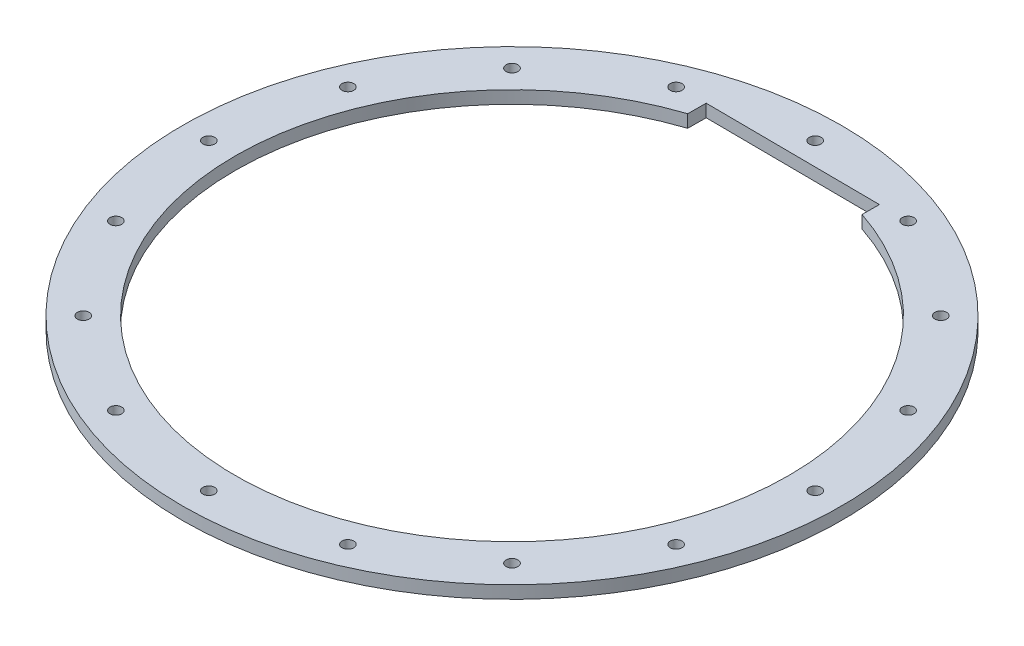
ISO-10303-21;
HEADER;
FILE_DESCRIPTION(('STEP AP214'),'2;1');
FILE_NAME('part.step','',(''),(''),'','','');
FILE_SCHEMA(('AUTOMOTIVE_DESIGN { 1 0 10303 214 1 1 1 1 }'));
ENDSEC;
DATA;
#1=APPLICATION_CONTEXT('core data for automotive mechanical design processes');
#2=APPLICATION_PROTOCOL_DEFINITION('international standard','automotive_design',2000,#1);
#3=PRODUCT_CONTEXT('',#1,'mechanical');
#4=PRODUCT('Part','Part','',(#3));
#5=PRODUCT_RELATED_PRODUCT_CATEGORY('part','',(#4));
#6=PRODUCT_DEFINITION_FORMATION('','',#4);
#7=PRODUCT_DEFINITION_CONTEXT('part definition',#1,'design');
#8=PRODUCT_DEFINITION('design','',#6,#7);
#9=PRODUCT_DEFINITION_SHAPE('','',#8);
#10=(LENGTH_UNIT() NAMED_UNIT(*) SI_UNIT(.MILLI.,.METRE.));
#11=(NAMED_UNIT(*) PLANE_ANGLE_UNIT() SI_UNIT($,.RADIAN.));
#12=(NAMED_UNIT(*) SI_UNIT($,.STERADIAN.) SOLID_ANGLE_UNIT());
#13=UNCERTAINTY_MEASURE_WITH_UNIT(LENGTH_MEASURE(1.E-05),#10,'distance_accuracy_value','');
#14=(GEOMETRIC_REPRESENTATION_CONTEXT(3) GLOBAL_UNCERTAINTY_ASSIGNED_CONTEXT((#13)) GLOBAL_UNIT_ASSIGNED_CONTEXT((#10,
#11,#12)) REPRESENTATION_CONTEXT('',''));
#15=CARTESIAN_POINT('',(0.,0.,0.));
#16=DIRECTION('',(0.,0.,1.));
#17=DIRECTION('',(1.,0.,0.));
#18=AXIS2_PLACEMENT_3D('',#15,#16,#17);
#19=CARTESIAN_POINT('',(0.,3.048,0.));
#20=DIRECTION('',(0.,1.,0.));
#21=DIRECTION('',(0.,0.,1.));
#22=AXIS2_PLACEMENT_3D('',#19,#20,#21);
#23=PLANE('',#22);
#24=CARTESIAN_POINT('',(-27.9454576484607,3.048,-67.4663028616367));
#25=DIRECTION('',(0.,1.,0.));
#26=DIRECTION('',(0.,0.,1.));
#27=AXIS2_PLACEMENT_3D('',#24,#25,#26);
#28=CIRCLE('',#27,1.42240000000098);
#29=CARTESIAN_POINT('',(-27.9454576484607,3.048,-66.0439028616357));
#30=VERTEX_POINT('',#29);
#31=EDGE_CURVE('E187',#30,#30,#28,.T.);
#32=ORIENTED_EDGE('',*,*,#31,.F.);
#33=EDGE_LOOP('',(#32));
#34=FACE_BOUND('',#33,.T.);
#35=CARTESIAN_POINT('',(-67.4663028616367,3.048,-27.9454576484607));
#36=DIRECTION('',(0.,1.,0.));
#37=DIRECTION('',(0.,0.,1.));
#38=AXIS2_PLACEMENT_3D('',#35,#36,#37);
#39=CIRCLE('',#38,1.42240000000074);
#40=CARTESIAN_POINT('',(-67.4663028616367,3.048,-26.52305764846));
#41=VERTEX_POINT('',#40);
#42=EDGE_CURVE('E175',#41,#41,#39,.T.);
#43=ORIENTED_EDGE('',*,*,#42,.F.);
#44=EDGE_LOOP('',(#43));
#45=FACE_BOUND('',#44,.T.);
#46=CARTESIAN_POINT('',(-67.4663028616367,3.048,27.9454576484607));
#47=DIRECTION('',(0.,1.,0.));
#48=DIRECTION('',(0.,0.,1.));
#49=AXIS2_PLACEMENT_3D('',#46,#47,#48);
#50=CIRCLE('',#49,1.42240000000076);
#51=CARTESIAN_POINT('',(-67.4663028616367,3.048,29.3678576484615));
#52=VERTEX_POINT('',#51);
#53=EDGE_CURVE('E163',#52,#52,#50,.T.);
#54=ORIENTED_EDGE('',*,*,#53,.F.);
#55=EDGE_LOOP('',(#54));
#56=FACE_BOUND('',#55,.T.);
#57=CARTESIAN_POINT('',(-27.9454576484607,3.048,67.4663028616367));
#58=DIRECTION('',(0.,1.,0.));
#59=DIRECTION('',(0.,0.,1.));
#60=AXIS2_PLACEMENT_3D('',#57,#58,#59);
#61=CIRCLE('',#60,1.42240000000056);
#62=CARTESIAN_POINT('',(-27.9454576484607,3.048,68.8887028616373));
#63=VERTEX_POINT('',#62);
#64=EDGE_CURVE('E151',#63,#63,#61,.T.);
#65=ORIENTED_EDGE('',*,*,#64,.F.);
#66=EDGE_LOOP('',(#65));
#67=FACE_BOUND('',#66,.T.);
#68=CARTESIAN_POINT('',(27.9454576484607,3.048,67.4663028616367));
#69=DIRECTION('',(0.,1.,0.));
#70=DIRECTION('',(0.,0.,1.));
#71=AXIS2_PLACEMENT_3D('',#68,#69,#70);
#72=CIRCLE('',#71,1.42240000000044);
#73=CARTESIAN_POINT('',(27.9454576484607,3.048,68.8887028616371));
#74=VERTEX_POINT('',#73);
#75=EDGE_CURVE('E139',#74,#74,#72,.T.);
#76=ORIENTED_EDGE('',*,*,#75,.F.);
#77=EDGE_LOOP('',(#76));
#78=FACE_BOUND('',#77,.T.);
#79=CARTESIAN_POINT('',(67.4663028616367,3.048,27.9454576484607));
#80=DIRECTION('',(0.,1.,0.));
#81=DIRECTION('',(0.,0.,1.));
#82=AXIS2_PLACEMENT_3D('',#79,#80,#81);
#83=CIRCLE('',#82,1.42240000000031);
#84=CARTESIAN_POINT('',(67.4663028616367,3.048,29.367857648461));
#85=VERTEX_POINT('',#84);
#86=EDGE_CURVE('E127',#85,#85,#83,.T.);
#87=ORIENTED_EDGE('',*,*,#86,.F.);
#88=EDGE_LOOP('',(#87));
#89=FACE_BOUND('',#88,.T.);
#90=CARTESIAN_POINT('',(67.4663028616367,3.048,-27.9454576484607));
#91=DIRECTION('',(0.,1.,0.));
#92=DIRECTION('',(0.,0.,1.));
#93=AXIS2_PLACEMENT_3D('',#90,#91,#92);
#94=CIRCLE('',#93,1.42240000000019);
#95=CARTESIAN_POINT('',(67.4663028616367,3.048,-26.5230576484605));
#96=VERTEX_POINT('',#95);
#97=EDGE_CURVE('E115',#96,#96,#94,.T.);
#98=ORIENTED_EDGE('',*,*,#97,.F.);
#99=EDGE_LOOP('',(#98));
#100=FACE_BOUND('',#99,.T.);
#101=CARTESIAN_POINT('',(27.9454576484618,3.048,-67.4663028616367));
#102=DIRECTION('',(0.,1.,0.));
#103=DIRECTION('',(0.,0.,1.));
#104=AXIS2_PLACEMENT_3D('',#101,#102,#103);
#105=CIRCLE('',#104,1.42239999999896);
#106=CARTESIAN_POINT('',(27.9454576484618,3.048,-66.0439028616377));
#107=VERTEX_POINT('',#106);
#108=EDGE_CURVE('E103',#107,#107,#105,.T.);
#109=ORIENTED_EDGE('',*,*,#108,.F.);
#110=EDGE_LOOP('',(#109));
#111=FACE_BOUND('',#110,.T.);
#112=CARTESIAN_POINT('',(0.,3.048,0.));
#113=DIRECTION('',(0.,1.,0.));
#114=DIRECTION('',(0.,0.,1.));
#115=AXIS2_PLACEMENT_3D('',#112,#113,#114);
#116=CIRCLE('',#115,79.375);
#117=CARTESIAN_POINT('',(0.,3.048,79.375));
#118=VERTEX_POINT('',#117);
#119=EDGE_CURVE('E11',#118,#118,#116,.T.);
#120=ORIENTED_EDGE('',*,*,#119,.T.);
#121=EDGE_LOOP('',(#120));
#122=FACE_BOUND('',#121,.T.);
#123=CARTESIAN_POINT('',(0.,3.048,-73.025));
#124=DIRECTION('',(0.,1.,0.));
#125=DIRECTION('',(0.,0.,1.));
#126=AXIS2_PLACEMENT_3D('',#123,#124,#125);
#127=CIRCLE('',#126,1.4224);
#128=CARTESIAN_POINT('',(0.,3.048,-71.6026));
#129=VERTEX_POINT('',#128);
#130=EDGE_CURVE('E97',#129,#129,#127,.T.);
#131=ORIENTED_EDGE('',*,*,#130,.F.);
#132=EDGE_LOOP('',(#131));
#133=FACE_BOUND('',#132,.T.);
#134=CARTESIAN_POINT('',(51.6364726961476,3.048,-51.6364726961476));
#135=DIRECTION('',(0.,1.,0.));
#136=DIRECTION('',(0.,0.,1.));
#137=AXIS2_PLACEMENT_3D('',#134,#135,#136);
#138=CIRCLE('',#137,1.42240000000012);
#139=CARTESIAN_POINT('',(51.6364726961476,3.048,-50.2140726961475));
#140=VERTEX_POINT('',#139);
#141=EDGE_CURVE('E109',#140,#140,#138,.T.);
#142=ORIENTED_EDGE('',*,*,#141,.F.);
#143=EDGE_LOOP('',(#142));
#144=FACE_BOUND('',#143,.T.);
#145=CARTESIAN_POINT('',(73.025,3.048,0.));
#146=DIRECTION('',(0.,1.,0.));
#147=DIRECTION('',(0.,0.,1.));
#148=AXIS2_PLACEMENT_3D('',#145,#146,#147);
#149=CIRCLE('',#148,1.42240000000025);
#150=CARTESIAN_POINT('',(73.025,3.048,1.42240000000025));
#151=VERTEX_POINT('',#150);
#152=EDGE_CURVE('E121',#151,#151,#149,.T.);
#153=ORIENTED_EDGE('',*,*,#152,.F.);
#154=EDGE_LOOP('',(#153));
#155=FACE_BOUND('',#154,.T.);
#156=CARTESIAN_POINT('',(51.6364726961476,3.048,51.6364726961476));
#157=DIRECTION('',(0.,1.,0.));
#158=DIRECTION('',(0.,0.,1.));
#159=AXIS2_PLACEMENT_3D('',#156,#157,#158);
#160=CIRCLE('',#159,1.42240000000036);
#161=CARTESIAN_POINT('',(51.6364726961476,3.048,53.058872696148));
#162=VERTEX_POINT('',#161);
#163=EDGE_CURVE('E133',#162,#162,#160,.T.);
#164=ORIENTED_EDGE('',*,*,#163,.F.);
#165=EDGE_LOOP('',(#164));
#166=FACE_BOUND('',#165,.T.);
#167=CARTESIAN_POINT('',(0.,3.048,73.025));
#168=DIRECTION('',(0.,1.,0.));
#169=DIRECTION('',(0.,0.,1.));
#170=AXIS2_PLACEMENT_3D('',#167,#168,#169);
#171=CIRCLE('',#170,1.4224000000005);
#172=CARTESIAN_POINT('',(0.,3.048,74.4474000000005));
#173=VERTEX_POINT('',#172);
#174=EDGE_CURVE('E145',#173,#173,#171,.T.);
#175=ORIENTED_EDGE('',*,*,#174,.F.);
#176=EDGE_LOOP('',(#175));
#177=FACE_BOUND('',#176,.T.);
#178=CARTESIAN_POINT('',(-51.6364726961476,3.048,51.6364726961476));
#179=DIRECTION('',(0.,1.,0.));
#180=DIRECTION('',(0.,0.,1.));
#181=AXIS2_PLACEMENT_3D('',#178,#179,#180);
#182=CIRCLE('',#181,1.42240000000064);
#183=CARTESIAN_POINT('',(-51.6364726961476,3.048,53.0588726961483));
#184=VERTEX_POINT('',#183);
#185=EDGE_CURVE('E157',#184,#184,#182,.T.);
#186=ORIENTED_EDGE('',*,*,#185,.F.);
#187=EDGE_LOOP('',(#186));
#188=FACE_BOUND('',#187,.T.);
#189=CARTESIAN_POINT('',(-73.025,3.048,0.));
#190=DIRECTION('',(0.,1.,0.));
#191=DIRECTION('',(0.,0.,1.));
#192=AXIS2_PLACEMENT_3D('',#189,#190,#191);
#193=CIRCLE('',#192,1.42240000000074);
#194=CARTESIAN_POINT('',(-73.025,3.048,1.42240000000076));
#195=VERTEX_POINT('',#194);
#196=EDGE_CURVE('E169',#195,#195,#193,.T.);
#197=ORIENTED_EDGE('',*,*,#196,.F.);
#198=EDGE_LOOP('',(#197));
#199=FACE_BOUND('',#198,.T.);
#200=CARTESIAN_POINT('',(-51.6364726961476,3.048,-51.6364726961476));
#201=DIRECTION('',(0.,1.,0.));
#202=DIRECTION('',(0.,0.,1.));
#203=AXIS2_PLACEMENT_3D('',#200,#201,#202);
#204=CIRCLE('',#203,1.42240000000086);
#205=CARTESIAN_POINT('',(-51.6364726961476,3.048,-50.2140726961468));
#206=VERTEX_POINT('',#205);
#207=EDGE_CURVE('E181',#206,#206,#204,.T.);
#208=ORIENTED_EDGE('',*,*,#207,.F.);
#209=EDGE_LOOP('',(#208));
#210=FACE_BOUND('',#209,.T.);
#211=CARTESIAN_POINT('',(0.,3.048,0.));
#212=DIRECTION('',(0.,1.,0.));
#213=DIRECTION('',(0.,0.,1.));
#214=AXIS2_PLACEMENT_3D('',#211,#212,#213);
#215=CIRCLE('',#214,66.675);
#216=CARTESIAN_POINT('',(-20.9722114369326,3.048,-63.290773201507));
#217=VERTEX_POINT('',#216);
#218=CARTESIAN_POINT('',(21.0402290478888,3.048,-63.2681941153087));
#219=VERTEX_POINT('',#218);
#220=EDGE_CURVE('E88',#217,#219,#215,.T.);
#221=ORIENTED_EDGE('',*,*,#220,.F.);
#222=DIRECTION('',(-0.00688562784600188,0.,0.999976293783591));
#223=VECTOR('',#222,1.);
#224=CARTESIAN_POINT('',(-21.407003484413,3.048,-0.1474041536865));
#225=LINE('',#224,#223);
#226=CARTESIAN_POINT('',(-20.941758021366,3.048,-67.7134190825203));
#227=VERTEX_POINT('',#226);
#228=EDGE_CURVE('E90',#227,#217,#225,.T.);
#229=ORIENTED_EDGE('',*,*,#228,.F.);
#230=DIRECTION('',(0.999976293783591,0.,0.00688562784600023));
#231=VECTOR('',#230,1.);
#232=CARTESIAN_POINT('',(0.465245463046875,3.048,-67.5660149288338));
#233=LINE('',#232,#231);
#234=CARTESIAN_POINT('',(21.0688460425527,3.048,-67.4241428397053));
#235=VERTEX_POINT('',#234);
#236=EDGE_CURVE('E89',#227,#235,#233,.T.);
#237=ORIENTED_EDGE('',*,*,#236,.T.);
#238=DIRECTION('',(-0.00688562784600024,0.,0.999976293783591));
#239=VECTOR('',#238,1.);
#240=CARTESIAN_POINT('',(20.6036005795058,3.048,0.141872089128559));
#241=LINE('',#240,#239);
#242=EDGE_CURVE('E77',#235,#219,#241,.T.);
#243=ORIENTED_EDGE('',*,*,#242,.T.);
#244=EDGE_LOOP('',(#221,#229,#237,#243));
#245=FACE_BOUND('',#244,.T.);
#246=ADVANCED_FACE('F32',(#34,#45,#56,#67,#78,#89,#100,#111,#122,#133,#144,#155,#166,#177,#188,
#199,#210,#245),#23,.T.);
#247=CARTESIAN_POINT('',(0.,0.,0.));
#248=DIRECTION('',(0.,1.,0.));
#249=DIRECTION('',(0.,0.,1.));
#250=AXIS2_PLACEMENT_3D('',#247,#248,#249);
#251=PLANE('',#250);
#252=CARTESIAN_POINT('',(-27.9454576484607,0.,-67.4663028616367));
#253=DIRECTION('',(0.,1.,0.));
#254=DIRECTION('',(0.,0.,1.));
#255=AXIS2_PLACEMENT_3D('',#252,#253,#254);
#256=CIRCLE('',#255,1.42240000000098);
#257=CARTESIAN_POINT('',(-27.9454576484607,0.,-66.0439028616357));
#258=VERTEX_POINT('',#257);
#259=EDGE_CURVE('E190',#258,#258,#256,.T.);
#260=ORIENTED_EDGE('',*,*,#259,.T.);
#261=EDGE_LOOP('',(#260));
#262=FACE_BOUND('',#261,.T.);
#263=CARTESIAN_POINT('',(-67.4663028616367,0.,-27.9454576484607));
#264=DIRECTION('',(0.,1.,0.));
#265=DIRECTION('',(0.,0.,1.));
#266=AXIS2_PLACEMENT_3D('',#263,#264,#265);
#267=CIRCLE('',#266,1.42240000000074);
#268=CARTESIAN_POINT('',(-67.4663028616367,0.,-26.52305764846));
#269=VERTEX_POINT('',#268);
#270=EDGE_CURVE('E178',#269,#269,#267,.T.);
#271=ORIENTED_EDGE('',*,*,#270,.T.);
#272=EDGE_LOOP('',(#271));
#273=FACE_BOUND('',#272,.T.);
#274=CARTESIAN_POINT('',(-67.4663028616367,0.,27.9454576484607));
#275=DIRECTION('',(0.,1.,0.));
#276=DIRECTION('',(0.,0.,1.));
#277=AXIS2_PLACEMENT_3D('',#274,#275,#276);
#278=CIRCLE('',#277,1.42240000000076);
#279=CARTESIAN_POINT('',(-67.4663028616367,0.,29.3678576484615));
#280=VERTEX_POINT('',#279);
#281=EDGE_CURVE('E166',#280,#280,#278,.T.);
#282=ORIENTED_EDGE('',*,*,#281,.T.);
#283=EDGE_LOOP('',(#282));
#284=FACE_BOUND('',#283,.T.);
#285=CARTESIAN_POINT('',(-27.9454576484607,0.,67.4663028616367));
#286=DIRECTION('',(0.,1.,0.));
#287=DIRECTION('',(0.,0.,1.));
#288=AXIS2_PLACEMENT_3D('',#285,#286,#287);
#289=CIRCLE('',#288,1.42240000000056);
#290=CARTESIAN_POINT('',(-27.9454576484607,0.,68.8887028616373));
#291=VERTEX_POINT('',#290);
#292=EDGE_CURVE('E154',#291,#291,#289,.T.);
#293=ORIENTED_EDGE('',*,*,#292,.T.);
#294=EDGE_LOOP('',(#293));
#295=FACE_BOUND('',#294,.T.);
#296=CARTESIAN_POINT('',(27.9454576484607,0.,67.4663028616367));
#297=DIRECTION('',(0.,1.,0.));
#298=DIRECTION('',(0.,0.,1.));
#299=AXIS2_PLACEMENT_3D('',#296,#297,#298);
#300=CIRCLE('',#299,1.42240000000044);
#301=CARTESIAN_POINT('',(27.9454576484607,0.,68.8887028616371));
#302=VERTEX_POINT('',#301);
#303=EDGE_CURVE('E142',#302,#302,#300,.T.);
#304=ORIENTED_EDGE('',*,*,#303,.T.);
#305=EDGE_LOOP('',(#304));
#306=FACE_BOUND('',#305,.T.);
#307=CARTESIAN_POINT('',(67.4663028616367,0.,27.9454576484607));
#308=DIRECTION('',(0.,1.,0.));
#309=DIRECTION('',(0.,0.,1.));
#310=AXIS2_PLACEMENT_3D('',#307,#308,#309);
#311=CIRCLE('',#310,1.42240000000031);
#312=CARTESIAN_POINT('',(67.4663028616367,0.,29.367857648461));
#313=VERTEX_POINT('',#312);
#314=EDGE_CURVE('E130',#313,#313,#311,.T.);
#315=ORIENTED_EDGE('',*,*,#314,.T.);
#316=EDGE_LOOP('',(#315));
#317=FACE_BOUND('',#316,.T.);
#318=CARTESIAN_POINT('',(67.4663028616367,0.,-27.9454576484607));
#319=DIRECTION('',(0.,1.,0.));
#320=DIRECTION('',(0.,0.,1.));
#321=AXIS2_PLACEMENT_3D('',#318,#319,#320);
#322=CIRCLE('',#321,1.42240000000019);
#323=CARTESIAN_POINT('',(67.4663028616367,0.,-26.5230576484605));
#324=VERTEX_POINT('',#323);
#325=EDGE_CURVE('E118',#324,#324,#322,.T.);
#326=ORIENTED_EDGE('',*,*,#325,.T.);
#327=EDGE_LOOP('',(#326));
#328=FACE_BOUND('',#327,.T.);
#329=CARTESIAN_POINT('',(27.9454576484618,0.,-67.4663028616367));
#330=DIRECTION('',(0.,1.,0.));
#331=DIRECTION('',(0.,0.,1.));
#332=AXIS2_PLACEMENT_3D('',#329,#330,#331);
#333=CIRCLE('',#332,1.42239999999896);
#334=CARTESIAN_POINT('',(27.9454576484618,0.,-66.0439028616377));
#335=VERTEX_POINT('',#334);
#336=EDGE_CURVE('E106',#335,#335,#333,.T.);
#337=ORIENTED_EDGE('',*,*,#336,.T.);
#338=EDGE_LOOP('',(#337));
#339=FACE_BOUND('',#338,.T.);
#340=CARTESIAN_POINT('',(0.,0.,0.));
#341=DIRECTION('',(0.,1.,0.));
#342=DIRECTION('',(0.,0.,1.));
#343=AXIS2_PLACEMENT_3D('',#340,#341,#342);
#344=CIRCLE('',#343,79.375);
#345=CARTESIAN_POINT('',(0.,0.,79.375));
#346=VERTEX_POINT('',#345);
#347=EDGE_CURVE('E36',#346,#346,#344,.T.);
#348=ORIENTED_EDGE('',*,*,#347,.F.);
#349=EDGE_LOOP('',(#348));
#350=FACE_BOUND('',#349,.T.);
#351=CARTESIAN_POINT('',(0.,0.,-73.025));
#352=DIRECTION('',(0.,1.,0.));
#353=DIRECTION('',(0.,0.,1.));
#354=AXIS2_PLACEMENT_3D('',#351,#352,#353);
#355=CIRCLE('',#354,1.4224);
#356=CARTESIAN_POINT('',(0.,0.,-71.6026));
#357=VERTEX_POINT('',#356);
#358=EDGE_CURVE('E100',#357,#357,#355,.T.);
#359=ORIENTED_EDGE('',*,*,#358,.T.);
#360=EDGE_LOOP('',(#359));
#361=FACE_BOUND('',#360,.T.);
#362=CARTESIAN_POINT('',(51.6364726961476,0.,-51.6364726961476));
#363=DIRECTION('',(0.,1.,0.));
#364=DIRECTION('',(0.,0.,1.));
#365=AXIS2_PLACEMENT_3D('',#362,#363,#364);
#366=CIRCLE('',#365,1.42240000000012);
#367=CARTESIAN_POINT('',(51.6364726961476,0.,-50.2140726961475));
#368=VERTEX_POINT('',#367);
#369=EDGE_CURVE('E112',#368,#368,#366,.T.);
#370=ORIENTED_EDGE('',*,*,#369,.T.);
#371=EDGE_LOOP('',(#370));
#372=FACE_BOUND('',#371,.T.);
#373=CARTESIAN_POINT('',(73.025,0.,0.));
#374=DIRECTION('',(0.,1.,0.));
#375=DIRECTION('',(0.,0.,1.));
#376=AXIS2_PLACEMENT_3D('',#373,#374,#375);
#377=CIRCLE('',#376,1.42240000000025);
#378=CARTESIAN_POINT('',(73.025,0.,1.42240000000025));
#379=VERTEX_POINT('',#378);
#380=EDGE_CURVE('E124',#379,#379,#377,.T.);
#381=ORIENTED_EDGE('',*,*,#380,.T.);
#382=EDGE_LOOP('',(#381));
#383=FACE_BOUND('',#382,.T.);
#384=CARTESIAN_POINT('',(51.6364726961476,0.,51.6364726961476));
#385=DIRECTION('',(0.,1.,0.));
#386=DIRECTION('',(0.,0.,1.));
#387=AXIS2_PLACEMENT_3D('',#384,#385,#386);
#388=CIRCLE('',#387,1.42240000000036);
#389=CARTESIAN_POINT('',(51.6364726961476,0.,53.058872696148));
#390=VERTEX_POINT('',#389);
#391=EDGE_CURVE('E136',#390,#390,#388,.T.);
#392=ORIENTED_EDGE('',*,*,#391,.T.);
#393=EDGE_LOOP('',(#392));
#394=FACE_BOUND('',#393,.T.);
#395=CARTESIAN_POINT('',(0.,0.,73.025));
#396=DIRECTION('',(0.,1.,0.));
#397=DIRECTION('',(0.,0.,1.));
#398=AXIS2_PLACEMENT_3D('',#395,#396,#397);
#399=CIRCLE('',#398,1.4224000000005);
#400=CARTESIAN_POINT('',(0.,0.,74.4474000000005));
#401=VERTEX_POINT('',#400);
#402=EDGE_CURVE('E148',#401,#401,#399,.T.);
#403=ORIENTED_EDGE('',*,*,#402,.T.);
#404=EDGE_LOOP('',(#403));
#405=FACE_BOUND('',#404,.T.);
#406=CARTESIAN_POINT('',(-51.6364726961476,0.,51.6364726961476));
#407=DIRECTION('',(0.,1.,0.));
#408=DIRECTION('',(0.,0.,1.));
#409=AXIS2_PLACEMENT_3D('',#406,#407,#408);
#410=CIRCLE('',#409,1.42240000000064);
#411=CARTESIAN_POINT('',(-51.6364726961476,0.,53.0588726961483));
#412=VERTEX_POINT('',#411);
#413=EDGE_CURVE('E160',#412,#412,#410,.T.);
#414=ORIENTED_EDGE('',*,*,#413,.T.);
#415=EDGE_LOOP('',(#414));
#416=FACE_BOUND('',#415,.T.);
#417=CARTESIAN_POINT('',(-73.025,0.,0.));
#418=DIRECTION('',(0.,1.,0.));
#419=DIRECTION('',(0.,0.,1.));
#420=AXIS2_PLACEMENT_3D('',#417,#418,#419);
#421=CIRCLE('',#420,1.42240000000074);
#422=CARTESIAN_POINT('',(-73.025,0.,1.42240000000076));
#423=VERTEX_POINT('',#422);
#424=EDGE_CURVE('E172',#423,#423,#421,.T.);
#425=ORIENTED_EDGE('',*,*,#424,.T.);
#426=EDGE_LOOP('',(#425));
#427=FACE_BOUND('',#426,.T.);
#428=CARTESIAN_POINT('',(-51.6364726961476,0.,-51.6364726961476));
#429=DIRECTION('',(0.,1.,0.));
#430=DIRECTION('',(0.,0.,1.));
#431=AXIS2_PLACEMENT_3D('',#428,#429,#430);
#432=CIRCLE('',#431,1.42240000000086);
#433=CARTESIAN_POINT('',(-51.6364726961476,0.,-50.2140726961468));
#434=VERTEX_POINT('',#433);
#435=EDGE_CURVE('E184',#434,#434,#432,.T.);
#436=ORIENTED_EDGE('',*,*,#435,.T.);
#437=EDGE_LOOP('',(#436));
#438=FACE_BOUND('',#437,.T.);
#439=DIRECTION('',(-0.00688562784600188,0.,0.999976293783591));
#440=VECTOR('',#439,1.);
#441=CARTESIAN_POINT('',(-21.407003484413,0.,-0.1474041536865));
#442=LINE('',#441,#440);
#443=CARTESIAN_POINT('',(-20.941758021366,0.,-67.7134190825203));
#444=VERTEX_POINT('',#443);
#445=CARTESIAN_POINT('',(-20.9722114369326,0.,-63.290773201507));
#446=VERTEX_POINT('',#445);
#447=EDGE_CURVE('E198',#444,#446,#442,.T.);
#448=ORIENTED_EDGE('',*,*,#447,.T.);
#449=CARTESIAN_POINT('',(0.,0.,0.));
#450=DIRECTION('',(0.,1.,0.));
#451=DIRECTION('',(0.,0.,1.));
#452=AXIS2_PLACEMENT_3D('',#449,#450,#451);
#453=CIRCLE('',#452,66.675);
#454=CARTESIAN_POINT('',(21.0402290478888,0.,-63.2681941153087));
#455=VERTEX_POINT('',#454);
#456=EDGE_CURVE('E94',#446,#455,#453,.T.);
#457=ORIENTED_EDGE('',*,*,#456,.T.);
#458=DIRECTION('',(-0.00688562784600024,0.,0.999976293783591));
#459=VECTOR('',#458,1.);
#460=CARTESIAN_POINT('',(20.6036005795058,0.,0.141872089128559));
#461=LINE('',#460,#459);
#462=CARTESIAN_POINT('',(21.0688460425527,0.,-67.4241428397053));
#463=VERTEX_POINT('',#462);
#464=EDGE_CURVE('E47',#463,#455,#461,.T.);
#465=ORIENTED_EDGE('',*,*,#464,.F.);
#466=DIRECTION('',(0.999976293783591,0.,0.00688562784600023));
#467=VECTOR('',#466,1.);
#468=CARTESIAN_POINT('',(0.465245463046875,0.,-67.5660149288338));
#469=LINE('',#468,#467);
#470=EDGE_CURVE('E202',#444,#463,#469,.T.);
#471=ORIENTED_EDGE('',*,*,#470,.F.);
#472=EDGE_LOOP('',(#448,#457,#465,#471));
#473=FACE_BOUND('',#472,.T.);
#474=ADVANCED_FACE('F208',(#262,#273,#284,#295,#306,#317,#328,#339,#350,#361,#372,#383,#394,
#405,#416,#427,#438,#473),#251,.F.);
#475=CARTESIAN_POINT('',(0.,3.048,0.));
#476=DIRECTION('',(0.,-1.,0.));
#477=DIRECTION('',(0.,0.,-1.));
#478=AXIS2_PLACEMENT_3D('',#475,#476,#477);
#479=CYLINDRICAL_SURFACE('',#478,66.675);
#480=ORIENTED_EDGE('',*,*,#456,.F.);
#481=DIRECTION('',(0.,-1.,0.));
#482=VECTOR('',#481,1.);
#483=CARTESIAN_POINT('',(-20.9722114369326,3.048,-63.290773201507));
#484=LINE('',#483,#482);
#485=EDGE_CURVE('E83',#217,#446,#484,.T.);
#486=ORIENTED_EDGE('',*,*,#485,.F.);
#487=ORIENTED_EDGE('',*,*,#220,.T.);
#488=DIRECTION('',(0.,-1.,0.));
#489=VECTOR('',#488,1.);
#490=CARTESIAN_POINT('',(21.0402290478888,3.048,-63.2681941153087));
#491=LINE('',#490,#489);
#492=EDGE_CURVE('E74',#219,#455,#491,.T.);
#493=ORIENTED_EDGE('',*,*,#492,.T.);
#494=EDGE_LOOP('',(#480,#486,#487,#493));
#495=FACE_BOUND('',#494,.T.);
#496=ADVANCED_FACE('F93',(#495),#479,.F.);
#497=CARTESIAN_POINT('',(0.,3.048,0.));
#498=DIRECTION('',(0.,-1.,0.));
#499=DIRECTION('',(0.,0.,-1.));
#500=AXIS2_PLACEMENT_3D('',#497,#498,#499);
#501=CYLINDRICAL_SURFACE('',#500,79.375);
#502=ORIENTED_EDGE('',*,*,#119,.F.);
#503=EDGE_LOOP('',(#502));
#504=FACE_BOUND('',#503,.T.);
#505=ORIENTED_EDGE('',*,*,#347,.T.);
#506=EDGE_LOOP('',(#505));
#507=FACE_BOUND('',#506,.T.);
#508=ADVANCED_FACE('F34',(#504,#507),#501,.T.);
#509=CARTESIAN_POINT('',(0.,3.048,-73.025));
#510=DIRECTION('',(0.,-1.,0.));
#511=DIRECTION('',(0.,0.,-1.));
#512=AXIS2_PLACEMENT_3D('',#509,#510,#511);
#513=CYLINDRICAL_SURFACE('',#512,1.4224);
#514=ORIENTED_EDGE('',*,*,#130,.T.);
#515=EDGE_LOOP('',(#514));
#516=FACE_BOUND('',#515,.T.);
#517=ORIENTED_EDGE('',*,*,#358,.F.);
#518=EDGE_LOOP('',(#517));
#519=FACE_BOUND('',#518,.T.);
#520=ADVANCED_FACE('F234',(#516,#519),#513,.F.);
#521=CARTESIAN_POINT('',(27.9454576484618,3.048,-67.4663028616367));
#522=DIRECTION('',(0.,-1.,0.));
#523=DIRECTION('',(0.,0.,-1.));
#524=AXIS2_PLACEMENT_3D('',#521,#522,#523);
#525=CYLINDRICAL_SURFACE('',#524,1.42239999999896);
#526=ORIENTED_EDGE('',*,*,#108,.T.);
#527=EDGE_LOOP('',(#526));
#528=FACE_BOUND('',#527,.T.);
#529=ORIENTED_EDGE('',*,*,#336,.F.);
#530=EDGE_LOOP('',(#529));
#531=FACE_BOUND('',#530,.T.);
#532=ADVANCED_FACE('F237',(#528,#531),#525,.F.);
#533=CARTESIAN_POINT('',(51.6364726961476,3.048,-51.6364726961476));
#534=DIRECTION('',(0.,-1.,0.));
#535=DIRECTION('',(0.,0.,-1.));
#536=AXIS2_PLACEMENT_3D('',#533,#534,#535);
#537=CYLINDRICAL_SURFACE('',#536,1.42240000000012);
#538=ORIENTED_EDGE('',*,*,#141,.T.);
#539=EDGE_LOOP('',(#538));
#540=FACE_BOUND('',#539,.T.);
#541=ORIENTED_EDGE('',*,*,#369,.F.);
#542=EDGE_LOOP('',(#541));
#543=FACE_BOUND('',#542,.T.);
#544=ADVANCED_FACE('F241',(#540,#543),#537,.F.);
#545=CARTESIAN_POINT('',(67.4663028616367,3.048,-27.9454576484607));
#546=DIRECTION('',(0.,-1.,0.));
#547=DIRECTION('',(0.,0.,-1.));
#548=AXIS2_PLACEMENT_3D('',#545,#546,#547);
#549=CYLINDRICAL_SURFACE('',#548,1.42240000000019);
#550=ORIENTED_EDGE('',*,*,#97,.T.);
#551=EDGE_LOOP('',(#550));
#552=FACE_BOUND('',#551,.T.);
#553=ORIENTED_EDGE('',*,*,#325,.F.);
#554=EDGE_LOOP('',(#553));
#555=FACE_BOUND('',#554,.T.);
#556=ADVANCED_FACE('F245',(#552,#555),#549,.F.);
#557=CARTESIAN_POINT('',(73.025,3.048,0.));
#558=DIRECTION('',(0.,-1.,0.));
#559=DIRECTION('',(0.,0.,-1.));
#560=AXIS2_PLACEMENT_3D('',#557,#558,#559);
#561=CYLINDRICAL_SURFACE('',#560,1.42240000000025);
#562=ORIENTED_EDGE('',*,*,#152,.T.);
#563=EDGE_LOOP('',(#562));
#564=FACE_BOUND('',#563,.T.);
#565=ORIENTED_EDGE('',*,*,#380,.F.);
#566=EDGE_LOOP('',(#565));
#567=FACE_BOUND('',#566,.T.);
#568=ADVANCED_FACE('F249',(#564,#567),#561,.F.);
#569=CARTESIAN_POINT('',(67.4663028616367,3.048,27.9454576484607));
#570=DIRECTION('',(0.,-1.,0.));
#571=DIRECTION('',(0.,0.,-1.));
#572=AXIS2_PLACEMENT_3D('',#569,#570,#571);
#573=CYLINDRICAL_SURFACE('',#572,1.42240000000031);
#574=ORIENTED_EDGE('',*,*,#86,.T.);
#575=EDGE_LOOP('',(#574));
#576=FACE_BOUND('',#575,.T.);
#577=ORIENTED_EDGE('',*,*,#314,.F.);
#578=EDGE_LOOP('',(#577));
#579=FACE_BOUND('',#578,.T.);
#580=ADVANCED_FACE('F253',(#576,#579),#573,.F.);
#581=CARTESIAN_POINT('',(51.6364726961476,3.048,51.6364726961476));
#582=DIRECTION('',(0.,-1.,0.));
#583=DIRECTION('',(0.,0.,-1.));
#584=AXIS2_PLACEMENT_3D('',#581,#582,#583);
#585=CYLINDRICAL_SURFACE('',#584,1.42240000000036);
#586=ORIENTED_EDGE('',*,*,#163,.T.);
#587=EDGE_LOOP('',(#586));
#588=FACE_BOUND('',#587,.T.);
#589=ORIENTED_EDGE('',*,*,#391,.F.);
#590=EDGE_LOOP('',(#589));
#591=FACE_BOUND('',#590,.T.);
#592=ADVANCED_FACE('F257',(#588,#591),#585,.F.);
#593=CARTESIAN_POINT('',(27.9454576484607,3.048,67.4663028616367));
#594=DIRECTION('',(0.,-1.,0.));
#595=DIRECTION('',(0.,0.,-1.));
#596=AXIS2_PLACEMENT_3D('',#593,#594,#595);
#597=CYLINDRICAL_SURFACE('',#596,1.42240000000044);
#598=ORIENTED_EDGE('',*,*,#75,.T.);
#599=EDGE_LOOP('',(#598));
#600=FACE_BOUND('',#599,.T.);
#601=ORIENTED_EDGE('',*,*,#303,.F.);
#602=EDGE_LOOP('',(#601));
#603=FACE_BOUND('',#602,.T.);
#604=ADVANCED_FACE('F261',(#600,#603),#597,.F.);
#605=CARTESIAN_POINT('',(0.,3.048,73.025));
#606=DIRECTION('',(0.,-1.,0.));
#607=DIRECTION('',(0.,0.,-1.));
#608=AXIS2_PLACEMENT_3D('',#605,#606,#607);
#609=CYLINDRICAL_SURFACE('',#608,1.4224000000005);
#610=ORIENTED_EDGE('',*,*,#174,.T.);
#611=EDGE_LOOP('',(#610));
#612=FACE_BOUND('',#611,.T.);
#613=ORIENTED_EDGE('',*,*,#402,.F.);
#614=EDGE_LOOP('',(#613));
#615=FACE_BOUND('',#614,.T.);
#616=ADVANCED_FACE('F265',(#612,#615),#609,.F.);
#617=CARTESIAN_POINT('',(-27.9454576484607,3.048,67.4663028616367));
#618=DIRECTION('',(0.,-1.,0.));
#619=DIRECTION('',(0.,0.,-1.));
#620=AXIS2_PLACEMENT_3D('',#617,#618,#619);
#621=CYLINDRICAL_SURFACE('',#620,1.42240000000056);
#622=ORIENTED_EDGE('',*,*,#64,.T.);
#623=EDGE_LOOP('',(#622));
#624=FACE_BOUND('',#623,.T.);
#625=ORIENTED_EDGE('',*,*,#292,.F.);
#626=EDGE_LOOP('',(#625));
#627=FACE_BOUND('',#626,.T.);
#628=ADVANCED_FACE('F269',(#624,#627),#621,.F.);
#629=CARTESIAN_POINT('',(-51.6364726961476,3.048,51.6364726961476));
#630=DIRECTION('',(0.,-1.,0.));
#631=DIRECTION('',(0.,0.,-1.));
#632=AXIS2_PLACEMENT_3D('',#629,#630,#631);
#633=CYLINDRICAL_SURFACE('',#632,1.42240000000064);
#634=ORIENTED_EDGE('',*,*,#185,.T.);
#635=EDGE_LOOP('',(#634));
#636=FACE_BOUND('',#635,.T.);
#637=ORIENTED_EDGE('',*,*,#413,.F.);
#638=EDGE_LOOP('',(#637));
#639=FACE_BOUND('',#638,.T.);
#640=ADVANCED_FACE('F273',(#636,#639),#633,.F.);
#641=CARTESIAN_POINT('',(-67.4663028616367,3.048,27.9454576484607));
#642=DIRECTION('',(0.,-1.,0.));
#643=DIRECTION('',(0.,0.,-1.));
#644=AXIS2_PLACEMENT_3D('',#641,#642,#643);
#645=CYLINDRICAL_SURFACE('',#644,1.42240000000076);
#646=ORIENTED_EDGE('',*,*,#53,.T.);
#647=EDGE_LOOP('',(#646));
#648=FACE_BOUND('',#647,.T.);
#649=ORIENTED_EDGE('',*,*,#281,.F.);
#650=EDGE_LOOP('',(#649));
#651=FACE_BOUND('',#650,.T.);
#652=ADVANCED_FACE('F277',(#648,#651),#645,.F.);
#653=CARTESIAN_POINT('',(-73.025,3.048,0.));
#654=DIRECTION('',(0.,-1.,0.));
#655=DIRECTION('',(0.,0.,-1.));
#656=AXIS2_PLACEMENT_3D('',#653,#654,#655);
#657=CYLINDRICAL_SURFACE('',#656,1.42240000000074);
#658=ORIENTED_EDGE('',*,*,#196,.T.);
#659=EDGE_LOOP('',(#658));
#660=FACE_BOUND('',#659,.T.);
#661=ORIENTED_EDGE('',*,*,#424,.F.);
#662=EDGE_LOOP('',(#661));
#663=FACE_BOUND('',#662,.T.);
#664=ADVANCED_FACE('F281',(#660,#663),#657,.F.);
#665=CARTESIAN_POINT('',(-67.4663028616367,3.048,-27.9454576484607));
#666=DIRECTION('',(0.,-1.,0.));
#667=DIRECTION('',(0.,0.,-1.));
#668=AXIS2_PLACEMENT_3D('',#665,#666,#667);
#669=CYLINDRICAL_SURFACE('',#668,1.42240000000074);
#670=ORIENTED_EDGE('',*,*,#42,.T.);
#671=EDGE_LOOP('',(#670));
#672=FACE_BOUND('',#671,.T.);
#673=ORIENTED_EDGE('',*,*,#270,.F.);
#674=EDGE_LOOP('',(#673));
#675=FACE_BOUND('',#674,.T.);
#676=ADVANCED_FACE('F285',(#672,#675),#669,.F.);
#677=CARTESIAN_POINT('',(-51.6364726961476,3.048,-51.6364726961476));
#678=DIRECTION('',(0.,-1.,0.));
#679=DIRECTION('',(0.,0.,-1.));
#680=AXIS2_PLACEMENT_3D('',#677,#678,#679);
#681=CYLINDRICAL_SURFACE('',#680,1.42240000000086);
#682=ORIENTED_EDGE('',*,*,#207,.T.);
#683=EDGE_LOOP('',(#682));
#684=FACE_BOUND('',#683,.T.);
#685=ORIENTED_EDGE('',*,*,#435,.F.);
#686=EDGE_LOOP('',(#685));
#687=FACE_BOUND('',#686,.T.);
#688=ADVANCED_FACE('F218',(#684,#687),#681,.F.);
#689=CARTESIAN_POINT('',(-27.9454576484607,3.048,-67.4663028616367));
#690=DIRECTION('',(0.,-1.,0.));
#691=DIRECTION('',(0.,0.,-1.));
#692=AXIS2_PLACEMENT_3D('',#689,#690,#691);
#693=CYLINDRICAL_SURFACE('',#692,1.42240000000098);
#694=ORIENTED_EDGE('',*,*,#31,.T.);
#695=EDGE_LOOP('',(#694));
#696=FACE_BOUND('',#695,.T.);
#697=ORIENTED_EDGE('',*,*,#259,.F.);
#698=EDGE_LOOP('',(#697));
#699=FACE_BOUND('',#698,.T.);
#700=ADVANCED_FACE('F211',(#696,#699),#693,.F.);
#701=CARTESIAN_POINT('',(0.465245463046875,3.048,-67.5660149288338));
#702=DIRECTION('',(0.00688562784600023,0.,-0.999976293783591));
#703=DIRECTION('',(-0.999976293783591,0.,-0.00688562784600023));
#704=AXIS2_PLACEMENT_3D('',#701,#702,#703);
#705=PLANE('',#704);
#706=ORIENTED_EDGE('',*,*,#470,.T.);
#707=DIRECTION('',(0.,-1.,0.));
#708=VECTOR('',#707,1.);
#709=CARTESIAN_POINT('',(21.0688460425527,3.048,-67.4241428397053));
#710=LINE('',#709,#708);
#711=EDGE_CURVE('E72',#235,#463,#710,.T.);
#712=ORIENTED_EDGE('',*,*,#711,.F.);
#713=ORIENTED_EDGE('',*,*,#236,.F.);
#714=DIRECTION('',(0.,-1.,0.));
#715=VECTOR('',#714,1.);
#716=CARTESIAN_POINT('',(-20.941758021366,3.048,-67.7134190825203));
#717=LINE('',#716,#715);
#718=EDGE_CURVE('E56',#227,#444,#717,.T.);
#719=ORIENTED_EDGE('',*,*,#718,.T.);
#720=EDGE_LOOP('',(#706,#712,#713,#719));
#721=FACE_BOUND('',#720,.T.);
#722=ADVANCED_FACE('F209',(#721),#705,.F.);
#723=CARTESIAN_POINT('',(-21.407003484413,3.048,-0.1474041536865));
#724=DIRECTION('',(0.999976293783591,0.,0.00688562784600188));
#725=DIRECTION('',(0.00688562784600188,0.,-0.999976293783591));
#726=AXIS2_PLACEMENT_3D('',#723,#724,#725);
#727=PLANE('',#726);
#728=ORIENTED_EDGE('',*,*,#447,.F.);
#729=ORIENTED_EDGE('',*,*,#718,.F.);
#730=ORIENTED_EDGE('',*,*,#228,.T.);
#731=ORIENTED_EDGE('',*,*,#485,.T.);
#732=EDGE_LOOP('',(#728,#729,#730,#731));
#733=FACE_BOUND('',#732,.T.);
#734=ADVANCED_FACE('F205',(#733),#727,.T.);
#735=CARTESIAN_POINT('',(20.6036005795058,3.048,0.141872089128559));
#736=DIRECTION('',(0.999976293783591,0.,0.00688562784600024));
#737=DIRECTION('',(0.00688562784600024,0.,-0.999976293783591));
#738=AXIS2_PLACEMENT_3D('',#735,#736,#737);
#739=PLANE('',#738);
#740=ORIENTED_EDGE('',*,*,#464,.T.);
#741=ORIENTED_EDGE('',*,*,#492,.F.);
#742=ORIENTED_EDGE('',*,*,#242,.F.);
#743=ORIENTED_EDGE('',*,*,#711,.T.);
#744=EDGE_LOOP('',(#740,#741,#742,#743));
#745=FACE_BOUND('',#744,.T.);
#746=ADVANCED_FACE('F76',(#745),#739,.F.);
#747=CLOSED_SHELL('',(#246,#474,#496,#508,#520,#532,#544,#556,#568,#580,#592,#604,#616,#628,
#640,#652,#664,#676,#688,#700,#722,#734,#746));
#748=MANIFOLD_SOLID_BREP('B2',#747);
#749=ADVANCED_BREP_SHAPE_REPRESENTATION('',(#18,#748),#14);
#750=SHAPE_DEFINITION_REPRESENTATION(#9,#749);
ENDSEC;
END-ISO-10303-21;
